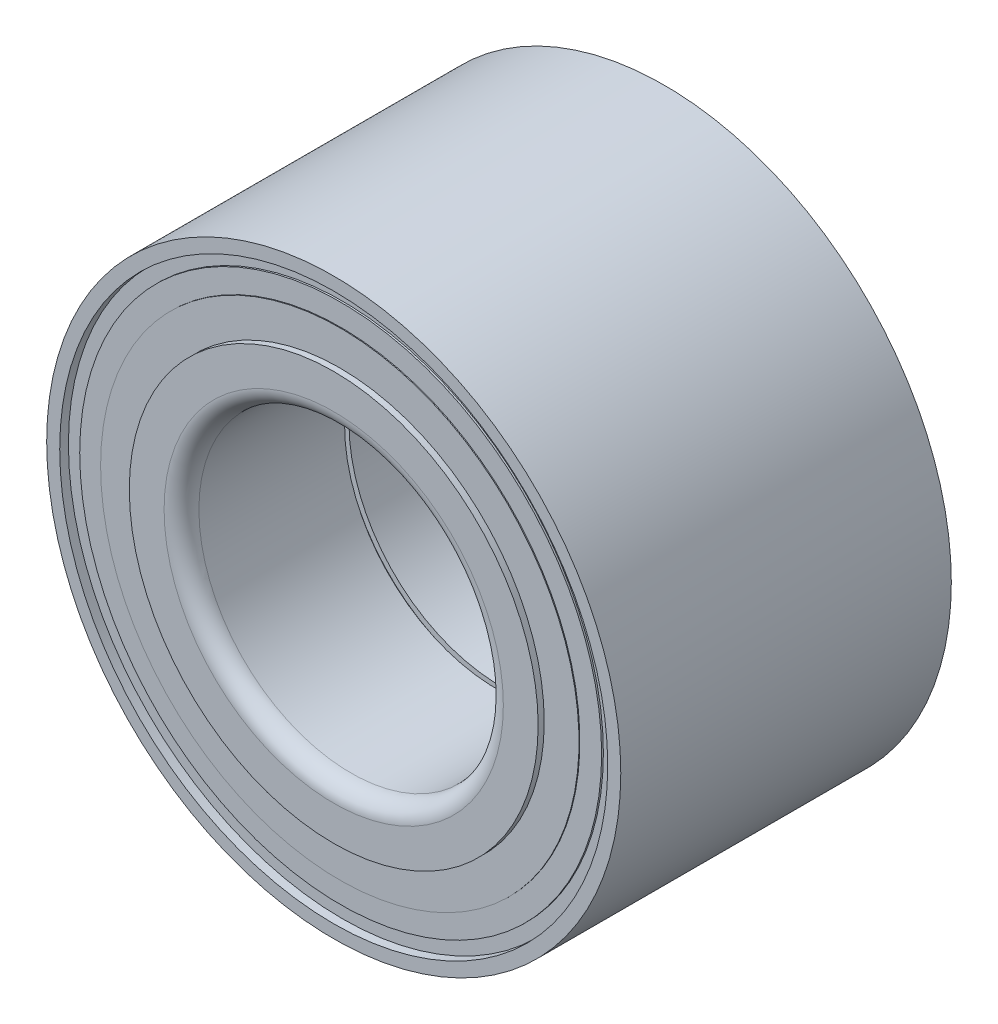
ISO-10303-21;
HEADER;
FILE_DESCRIPTION(('STEP AP214'),'2;1');
FILE_NAME('part.step','',(''),(''),'','','');
FILE_SCHEMA(('AUTOMOTIVE_DESIGN { 1 0 10303 214 1 1 1 1 }'));
ENDSEC;
DATA;
#1=APPLICATION_CONTEXT('core data for automotive mechanical design processes');
#2=APPLICATION_PROTOCOL_DEFINITION('international standard','automotive_design',2000,#1);
#3=PRODUCT_CONTEXT('',#1,'mechanical');
#4=PRODUCT('Part','Part','',(#3));
#5=PRODUCT_RELATED_PRODUCT_CATEGORY('part','',(#4));
#6=PRODUCT_DEFINITION_FORMATION('','',#4);
#7=PRODUCT_DEFINITION_CONTEXT('part definition',#1,'design');
#8=PRODUCT_DEFINITION('design','',#6,#7);
#9=PRODUCT_DEFINITION_SHAPE('','',#8);
#10=(LENGTH_UNIT() NAMED_UNIT(*) SI_UNIT(.MILLI.,.METRE.));
#11=(NAMED_UNIT(*) PLANE_ANGLE_UNIT() SI_UNIT($,.RADIAN.));
#12=(NAMED_UNIT(*) SI_UNIT($,.STERADIAN.) SOLID_ANGLE_UNIT());
#13=UNCERTAINTY_MEASURE_WITH_UNIT(LENGTH_MEASURE(1.E-05),#10,'distance_accuracy_value','');
#14=(GEOMETRIC_REPRESENTATION_CONTEXT(3) GLOBAL_UNCERTAINTY_ASSIGNED_CONTEXT((#13)) GLOBAL_UNIT_ASSIGNED_CONTEXT((#10,
#11,#12)) REPRESENTATION_CONTEXT('',''));
#15=CARTESIAN_POINT('',(0.,0.,0.));
#16=DIRECTION('',(0.,0.,1.));
#17=DIRECTION('',(1.,0.,0.));
#18=AXIS2_PLACEMENT_3D('',#15,#16,#17);
#19=CARTESIAN_POINT('',(0.,0.,-19.));
#20=DIRECTION('',(0.,0.,1.));
#21=DIRECTION('',(1.,0.,0.));
#22=AXIS2_PLACEMENT_3D('',#19,#20,#21);
#23=PLANE('',#22);
#24=CARTESIAN_POINT('',(0.,0.,-19.));
#25=DIRECTION('',(0.,0.,-1.));
#26=DIRECTION('',(-1.,0.,0.));
#27=AXIS2_PLACEMENT_3D('',#24,#25,#26);
#28=CIRCLE('',#27,23.5);
#29=CARTESIAN_POINT('',(-23.5,0.,-19.));
#30=VERTEX_POINT('',#29);
#31=EDGE_CURVE('E124',#30,#30,#28,.T.);
#32=ORIENTED_EDGE('',*,*,#31,.T.);
#33=EDGE_LOOP('',(#32));
#34=FACE_BOUND('',#33,.T.);
#35=CARTESIAN_POINT('',(0.,0.,-19.));
#36=DIRECTION('',(0.,0.,1.));
#37=DIRECTION('',(1.,0.,0.));
#38=AXIS2_PLACEMENT_3D('',#35,#36,#37);
#39=CIRCLE('',#38,19.5);
#40=CARTESIAN_POINT('',(19.5,0.,-19.));
#41=VERTEX_POINT('',#40);
#42=EDGE_CURVE('E42',#41,#41,#39,.T.);
#43=ORIENTED_EDGE('',*,*,#42,.T.);
#44=EDGE_LOOP('',(#43));
#45=FACE_BOUND('',#44,.T.);
#46=ADVANCED_FACE('F35',(#34,#45),#23,.F.);
#47=CARTESIAN_POINT('',(0.,0.,19.));
#48=DIRECTION('',(0.,0.,1.));
#49=DIRECTION('',(1.,0.,0.));
#50=AXIS2_PLACEMENT_3D('',#47,#48,#49);
#51=PLANE('',#50);
#52=CARTESIAN_POINT('',(0.,0.,19.));
#53=DIRECTION('',(0.,0.,-1.));
#54=DIRECTION('',(-1.,0.,0.));
#55=AXIS2_PLACEMENT_3D('',#52,#53,#54);
#56=CIRCLE('',#55,23.5);
#57=CARTESIAN_POINT('',(-23.5,0.,19.));
#58=VERTEX_POINT('',#57);
#59=EDGE_CURVE('E100',#58,#58,#56,.T.);
#60=ORIENTED_EDGE('',*,*,#59,.F.);
#61=EDGE_LOOP('',(#60));
#62=FACE_BOUND('',#61,.T.);
#63=CARTESIAN_POINT('',(0.,0.,19.));
#64=DIRECTION('',(0.,0.,1.));
#65=DIRECTION('',(1.,0.,0.));
#66=AXIS2_PLACEMENT_3D('',#63,#64,#65);
#67=CIRCLE('',#66,19.5);
#68=CARTESIAN_POINT('',(19.5,0.,19.));
#69=VERTEX_POINT('',#68);
#70=EDGE_CURVE('E46',#69,#69,#67,.F.);
#71=ORIENTED_EDGE('',*,*,#70,.T.);
#72=EDGE_LOOP('',(#71));
#73=FACE_BOUND('',#72,.T.);
#74=ADVANCED_FACE('F145',(#62,#73),#51,.T.);
#75=CARTESIAN_POINT('',(0.,0.,19.));
#76=DIRECTION('',(0.,0.,-1.));
#77=DIRECTION('',(-1.,0.,0.));
#78=AXIS2_PLACEMENT_3D('',#75,#76,#77);
#79=CYLINDRICAL_SURFACE('',#78,17.5);
#80=CARTESIAN_POINT('',(0.,0.,-17.));
#81=DIRECTION('',(0.,0.,1.));
#82=DIRECTION('',(1.,0.,0.));
#83=AXIS2_PLACEMENT_3D('',#80,#81,#82);
#84=CIRCLE('',#83,17.5);
#85=CARTESIAN_POINT('',(17.5,0.,-17.));
#86=VERTEX_POINT('',#85);
#87=EDGE_CURVE('E10',#86,#86,#84,.F.);
#88=ORIENTED_EDGE('',*,*,#87,.T.);
#89=EDGE_LOOP('',(#88));
#90=FACE_BOUND('',#89,.T.);
#91=CARTESIAN_POINT('',(0.,0.,-0.250000000000002));
#92=DIRECTION('',(0.,0.,1.));
#93=DIRECTION('',(1.,0.,0.));
#94=AXIS2_PLACEMENT_3D('',#91,#92,#93);
#95=CIRCLE('',#94,17.5);
#96=CARTESIAN_POINT('',(17.5,0.,-0.250000000000002));
#97=VERTEX_POINT('',#96);
#98=EDGE_CURVE('E70',#97,#97,#95,.T.);
#99=ORIENTED_EDGE('',*,*,#98,.T.);
#100=EDGE_LOOP('',(#99));
#101=FACE_BOUND('',#100,.T.);
#102=ADVANCED_FACE('F151',(#90,#101),#79,.F.);
#103=CARTESIAN_POINT('',(0.,0.,19.));
#104=DIRECTION('',(0.,0.,-1.));
#105=DIRECTION('',(-1.,0.,0.));
#106=AXIS2_PLACEMENT_3D('',#103,#104,#105);
#107=CIRCLE('',#106,31.5);
#108=CARTESIAN_POINT('',(-31.5,0.,19.));
#109=VERTEX_POINT('',#108);
#110=EDGE_CURVE('E97',#109,#109,#107,.T.);
#111=ORIENTED_EDGE('',*,*,#110,.T.);
#112=EDGE_LOOP('',(#111));
#113=FACE_BOUND('',#112,.T.);
#114=CARTESIAN_POINT('',(0.,0.,19.));
#115=DIRECTION('',(0.,0.,1.));
#116=DIRECTION('',(1.,0.,0.));
#117=AXIS2_PLACEMENT_3D('',#114,#115,#116);
#118=CIRCLE('',#117,33.);
#119=CARTESIAN_POINT('',(33.,0.,19.));
#120=VERTEX_POINT('',#119);
#121=EDGE_CURVE('E55',#120,#120,#118,.T.);
#122=ORIENTED_EDGE('',*,*,#121,.T.);
#123=EDGE_LOOP('',(#122));
#124=FACE_BOUND('',#123,.T.);
#125=ADVANCED_FACE('F154',(#113,#124),#51,.T.);
#126=CARTESIAN_POINT('',(0.,0.,-19.));
#127=DIRECTION('',(0.,0.,-1.));
#128=DIRECTION('',(-1.,0.,0.));
#129=AXIS2_PLACEMENT_3D('',#126,#127,#128);
#130=CIRCLE('',#129,31.5);
#131=CARTESIAN_POINT('',(-31.5,0.,-19.));
#132=VERTEX_POINT('',#131);
#133=EDGE_CURVE('E121',#132,#132,#130,.T.);
#134=ORIENTED_EDGE('',*,*,#133,.F.);
#135=EDGE_LOOP('',(#134));
#136=FACE_BOUND('',#135,.T.);
#137=CARTESIAN_POINT('',(0.,0.,-19.));
#138=DIRECTION('',(0.,0.,1.));
#139=DIRECTION('',(1.,0.,0.));
#140=AXIS2_PLACEMENT_3D('',#137,#138,#139);
#141=CIRCLE('',#140,33.);
#142=CARTESIAN_POINT('',(33.,0.,-19.));
#143=VERTEX_POINT('',#142);
#144=EDGE_CURVE('E56',#143,#143,#141,.T.);
#145=ORIENTED_EDGE('',*,*,#144,.F.);
#146=EDGE_LOOP('',(#145));
#147=FACE_BOUND('',#146,.T.);
#148=ADVANCED_FACE('F147',(#136,#147),#23,.F.);
#149=CARTESIAN_POINT('',(0.,0.,19.));
#150=DIRECTION('',(0.,0.,-1.));
#151=DIRECTION('',(-1.,0.,0.));
#152=AXIS2_PLACEMENT_3D('',#149,#150,#151);
#153=CYLINDRICAL_SURFACE('',#152,33.);
#154=ORIENTED_EDGE('',*,*,#121,.F.);
#155=EDGE_LOOP('',(#154));
#156=FACE_BOUND('',#155,.T.);
#157=ORIENTED_EDGE('',*,*,#144,.T.);
#158=EDGE_LOOP('',(#157));
#159=FACE_BOUND('',#158,.T.);
#160=ADVANCED_FACE('F157',(#156,#159),#153,.T.);
#161=CARTESIAN_POINT('',(0.,0.,17.));
#162=DIRECTION('',(0.,0.,1.));
#163=DIRECTION('',(1.,0.,0.));
#164=AXIS2_PLACEMENT_3D('',#161,#162,#163);
#165=CIRCLE('',#164,17.5);
#166=CARTESIAN_POINT('',(17.5,0.,17.));
#167=VERTEX_POINT('',#166);
#168=EDGE_CURVE('E50',#167,#167,#165,.T.);
#169=ORIENTED_EDGE('',*,*,#168,.T.);
#170=EDGE_LOOP('',(#169));
#171=FACE_BOUND('',#170,.T.);
#172=CARTESIAN_POINT('',(0.,0.,0.250000000000002));
#173=DIRECTION('',(0.,0.,1.));
#174=DIRECTION('',(1.,0.,0.));
#175=AXIS2_PLACEMENT_3D('',#172,#173,#174);
#176=CIRCLE('',#175,17.5);
#177=CARTESIAN_POINT('',(17.5,0.,0.250000000000002));
#178=VERTEX_POINT('',#177);
#179=EDGE_CURVE('E67',#178,#178,#176,.T.);
#180=ORIENTED_EDGE('',*,*,#179,.F.);
#181=EDGE_LOOP('',(#180));
#182=FACE_BOUND('',#181,.T.);
#183=ADVANCED_FACE('F163',(#171,#182),#79,.F.);
#184=CARTESIAN_POINT('',(0.,0.,0.));
#185=DIRECTION('',(0.,0.,1.));
#186=DIRECTION('',(1.,0.,0.));
#187=AXIS2_PLACEMENT_3D('',#184,#185,#186);
#188=CYLINDRICAL_SURFACE('',#187,18.5);
#189=CARTESIAN_POINT('',(0.,0.,-0.500000000000002));
#190=DIRECTION('',(0.,0.,1.));
#191=DIRECTION('',(1.,0.,0.));
#192=AXIS2_PLACEMENT_3D('',#189,#190,#191);
#193=CIRCLE('',#192,18.5);
#194=CARTESIAN_POINT('',(18.5,0.,-0.500000000000002));
#195=VERTEX_POINT('',#194);
#196=EDGE_CURVE('E76',#195,#195,#193,.T.);
#197=ORIENTED_EDGE('',*,*,#196,.F.);
#198=EDGE_LOOP('',(#197));
#199=FACE_BOUND('',#198,.T.);
#200=CARTESIAN_POINT('',(0.,0.,0.499999999999998));
#201=DIRECTION('',(0.,0.,1.));
#202=DIRECTION('',(1.,0.,0.));
#203=AXIS2_PLACEMENT_3D('',#200,#201,#202);
#204=CIRCLE('',#203,18.5);
#205=CARTESIAN_POINT('',(18.5,0.,0.499999999999998));
#206=VERTEX_POINT('',#205);
#207=EDGE_CURVE('E59',#206,#206,#204,.T.);
#208=ORIENTED_EDGE('',*,*,#207,.T.);
#209=EDGE_LOOP('',(#208));
#210=FACE_BOUND('',#209,.T.);
#211=ADVANCED_FACE('F367',(#199,#210),#188,.F.);
#212=CARTESIAN_POINT('',(18.5,0.,0.5));
#213=DIRECTION('',(0.,0.,1.));
#214=DIRECTION('',(1.,0.,0.));
#215=AXIS2_PLACEMENT_3D('',#212,#213,#214);
#216=PLANE('',#215);
#217=ORIENTED_EDGE('',*,*,#207,.F.);
#218=EDGE_LOOP('',(#217));
#219=FACE_BOUND('',#218,.T.);
#220=CARTESIAN_POINT('',(0.,0.,0.500000000000002));
#221=DIRECTION('',(0.,0.,1.));
#222=DIRECTION('',(1.,0.,0.));
#223=AXIS2_PLACEMENT_3D('',#220,#221,#222);
#224=CIRCLE('',#223,17.75);
#225=CARTESIAN_POINT('',(17.75,0.,0.500000000000002));
#226=VERTEX_POINT('',#225);
#227=EDGE_CURVE('E64',#226,#226,#224,.T.);
#228=ORIENTED_EDGE('',*,*,#227,.T.);
#229=EDGE_LOOP('',(#228));
#230=FACE_BOUND('',#229,.T.);
#231=ADVANCED_FACE('F358',(#219,#230),#216,.F.);
#232=CARTESIAN_POINT('',(0.,0.,0.250000000000002));
#233=DIRECTION('',(0.,0.,1.));
#234=DIRECTION('',(1.,0.,0.));
#235=AXIS2_PLACEMENT_3D('',#232,#233,#234);
#236=TOROIDAL_SURFACE('',#235,17.75,0.25);
#237=ORIENTED_EDGE('',*,*,#227,.F.);
#238=EDGE_LOOP('',(#237));
#239=FACE_BOUND('',#238,.T.);
#240=ORIENTED_EDGE('',*,*,#179,.T.);
#241=EDGE_LOOP('',(#240));
#242=FACE_BOUND('',#241,.T.);
#243=ADVANCED_FACE('F349',(#239,#242),#236,.F.);
#244=CARTESIAN_POINT('',(0.,0.,-0.250000000000002));
#245=DIRECTION('',(0.,0.,1.));
#246=DIRECTION('',(1.,0.,0.));
#247=AXIS2_PLACEMENT_3D('',#244,#245,#246);
#248=TOROIDAL_SURFACE('',#247,17.75,0.25);
#249=ORIENTED_EDGE('',*,*,#98,.F.);
#250=EDGE_LOOP('',(#249));
#251=FACE_BOUND('',#250,.T.);
#252=CARTESIAN_POINT('',(0.,0.,-0.500000000000002));
#253=DIRECTION('',(0.,0.,1.));
#254=DIRECTION('',(1.,0.,0.));
#255=AXIS2_PLACEMENT_3D('',#252,#253,#254);
#256=CIRCLE('',#255,17.75);
#257=CARTESIAN_POINT('',(17.75,0.,-0.500000000000002));
#258=VERTEX_POINT('',#257);
#259=EDGE_CURVE('E73',#258,#258,#256,.T.);
#260=ORIENTED_EDGE('',*,*,#259,.T.);
#261=EDGE_LOOP('',(#260));
#262=FACE_BOUND('',#261,.T.);
#263=ADVANCED_FACE('F339',(#251,#262),#248,.F.);
#264=CARTESIAN_POINT('',(17.75,0.,-0.500000000000002));
#265=DIRECTION('',(0.,0.,-1.));
#266=DIRECTION('',(-1.,0.,0.));
#267=AXIS2_PLACEMENT_3D('',#264,#265,#266);
#268=PLANE('',#267);
#269=ORIENTED_EDGE('',*,*,#259,.F.);
#270=EDGE_LOOP('',(#269));
#271=FACE_BOUND('',#270,.T.);
#272=ORIENTED_EDGE('',*,*,#196,.T.);
#273=EDGE_LOOP('',(#272));
#274=FACE_BOUND('',#273,.T.);
#275=ADVANCED_FACE('F329',(#271,#274),#268,.F.);
#276=CARTESIAN_POINT('',(0.,0.,17.));
#277=DIRECTION('',(0.,0.,1.));
#278=DIRECTION('',(1.,0.,0.));
#279=AXIS2_PLACEMENT_3D('',#276,#277,#278);
#280=TOROIDAL_SURFACE('',#279,19.5,2.);
#281=ORIENTED_EDGE('',*,*,#70,.F.);
#282=EDGE_LOOP('',(#281));
#283=FACE_BOUND('',#282,.T.);
#284=ORIENTED_EDGE('',*,*,#168,.F.);
#285=EDGE_LOOP('',(#284));
#286=FACE_BOUND('',#285,.T.);
#287=ADVANCED_FACE('F313',(#283,#286),#280,.T.);
#288=CARTESIAN_POINT('',(0.,0.,0.));
#289=DIRECTION('',(0.,0.,-1.));
#290=DIRECTION('',(-1.,0.,0.));
#291=AXIS2_PLACEMENT_3D('',#288,#289,#290);
#292=CYLINDRICAL_SURFACE('',#291,23.5);
#293=CARTESIAN_POINT('',(0.,0.,18.3));
#294=DIRECTION('',(0.,0.,-1.));
#295=DIRECTION('',(-1.,0.,0.));
#296=AXIS2_PLACEMENT_3D('',#293,#294,#295);
#297=CIRCLE('',#296,23.5);
#298=CARTESIAN_POINT('',(-23.5,0.,18.3));
#299=VERTEX_POINT('',#298);
#300=EDGE_CURVE('E79',#299,#299,#297,.T.);
#301=ORIENTED_EDGE('',*,*,#300,.F.);
#302=EDGE_LOOP('',(#301));
#303=FACE_BOUND('',#302,.T.);
#304=ORIENTED_EDGE('',*,*,#59,.T.);
#305=EDGE_LOOP('',(#304));
#306=FACE_BOUND('',#305,.T.);
#307=ADVANCED_FACE('F304',(#303,#306),#292,.T.);
#308=CARTESIAN_POINT('',(0.,23.5,18.3));
#309=DIRECTION('',(0.,0.,-1.));
#310=DIRECTION('',(-1.,0.,0.));
#311=AXIS2_PLACEMENT_3D('',#308,#309,#310);
#312=PLANE('',#311);
#313=CARTESIAN_POINT('',(0.,0.,18.3));
#314=DIRECTION('',(0.,0.,-1.));
#315=DIRECTION('',(-1.,0.,0.));
#316=AXIS2_PLACEMENT_3D('',#313,#314,#315);
#317=CIRCLE('',#316,27.5);
#318=CARTESIAN_POINT('',(-27.5,0.,18.3));
#319=VERTEX_POINT('',#318);
#320=EDGE_CURVE('E82',#319,#319,#317,.T.);
#321=ORIENTED_EDGE('',*,*,#320,.F.);
#322=EDGE_LOOP('',(#321));
#323=FACE_BOUND('',#322,.T.);
#324=ORIENTED_EDGE('',*,*,#300,.T.);
#325=EDGE_LOOP('',(#324));
#326=FACE_BOUND('',#325,.T.);
#327=ADVANCED_FACE('F295',(#323,#326),#312,.F.);
#328=CARTESIAN_POINT('',(0.,0.,0.));
#329=DIRECTION('',(0.,0.,-1.));
#330=DIRECTION('',(-1.,0.,0.));
#331=AXIS2_PLACEMENT_3D('',#328,#329,#330);
#332=CYLINDRICAL_SURFACE('',#331,27.5);
#333=CARTESIAN_POINT('',(0.,0.,18.2));
#334=DIRECTION('',(0.,0.,-1.));
#335=DIRECTION('',(-1.,0.,0.));
#336=AXIS2_PLACEMENT_3D('',#333,#334,#335);
#337=CIRCLE('',#336,27.5);
#338=CARTESIAN_POINT('',(-27.5,0.,18.2));
#339=VERTEX_POINT('',#338);
#340=EDGE_CURVE('E85',#339,#339,#337,.T.);
#341=ORIENTED_EDGE('',*,*,#340,.F.);
#342=EDGE_LOOP('',(#341));
#343=FACE_BOUND('',#342,.T.);
#344=ORIENTED_EDGE('',*,*,#320,.T.);
#345=EDGE_LOOP('',(#344));
#346=FACE_BOUND('',#345,.T.);
#347=ADVANCED_FACE('F286',(#343,#346),#332,.T.);
#348=CARTESIAN_POINT('',(0.,27.5,18.2));
#349=DIRECTION('',(0.,0.,-1.));
#350=DIRECTION('',(-1.,0.,0.));
#351=AXIS2_PLACEMENT_3D('',#348,#349,#350);
#352=PLANE('',#351);
#353=CARTESIAN_POINT('',(0.,0.,18.2));
#354=DIRECTION('',(0.,0.,-1.));
#355=DIRECTION('',(-1.,0.,0.));
#356=AXIS2_PLACEMENT_3D('',#353,#354,#355);
#357=CIRCLE('',#356,30.);
#358=CARTESIAN_POINT('',(-30.,0.,18.2));
#359=VERTEX_POINT('',#358);
#360=EDGE_CURVE('E88',#359,#359,#357,.T.);
#361=ORIENTED_EDGE('',*,*,#360,.F.);
#362=EDGE_LOOP('',(#361));
#363=FACE_BOUND('',#362,.T.);
#364=ORIENTED_EDGE('',*,*,#340,.T.);
#365=EDGE_LOOP('',(#364));
#366=FACE_BOUND('',#365,.T.);
#367=ADVANCED_FACE('F277',(#363,#366),#352,.F.);
#368=CARTESIAN_POINT('',(0.,0.,0.));
#369=DIRECTION('',(0.,0.,-1.));
#370=DIRECTION('',(-1.,0.,0.));
#371=AXIS2_PLACEMENT_3D('',#368,#369,#370);
#372=CYLINDRICAL_SURFACE('',#371,30.);
#373=CARTESIAN_POINT('',(0.,0.,18.));
#374=DIRECTION('',(0.,0.,-1.));
#375=DIRECTION('',(-1.,0.,0.));
#376=AXIS2_PLACEMENT_3D('',#373,#374,#375);
#377=CIRCLE('',#376,30.);
#378=CARTESIAN_POINT('',(-30.,0.,18.));
#379=VERTEX_POINT('',#378);
#380=EDGE_CURVE('E91',#379,#379,#377,.T.);
#381=ORIENTED_EDGE('',*,*,#380,.F.);
#382=EDGE_LOOP('',(#381));
#383=FACE_BOUND('',#382,.T.);
#384=ORIENTED_EDGE('',*,*,#360,.T.);
#385=EDGE_LOOP('',(#384));
#386=FACE_BOUND('',#385,.T.);
#387=ADVANCED_FACE('F268',(#383,#386),#372,.T.);
#388=CARTESIAN_POINT('',(0.,30.,18.));
#389=DIRECTION('',(0.,0.,-1.));
#390=DIRECTION('',(-1.,0.,0.));
#391=AXIS2_PLACEMENT_3D('',#388,#389,#390);
#392=PLANE('',#391);
#393=CARTESIAN_POINT('',(0.,0.,18.));
#394=DIRECTION('',(0.,0.,-1.));
#395=DIRECTION('',(-1.,0.,0.));
#396=AXIS2_PLACEMENT_3D('',#393,#394,#395);
#397=CIRCLE('',#396,31.5);
#398=CARTESIAN_POINT('',(-31.5,0.,18.));
#399=VERTEX_POINT('',#398);
#400=EDGE_CURVE('E94',#399,#399,#397,.T.);
#401=ORIENTED_EDGE('',*,*,#400,.F.);
#402=EDGE_LOOP('',(#401));
#403=FACE_BOUND('',#402,.T.);
#404=ORIENTED_EDGE('',*,*,#380,.T.);
#405=EDGE_LOOP('',(#404));
#406=FACE_BOUND('',#405,.T.);
#407=ADVANCED_FACE('F260',(#403,#406),#392,.F.);
#408=CARTESIAN_POINT('',(0.,0.,0.));
#409=DIRECTION('',(0.,0.,-1.));
#410=DIRECTION('',(-1.,0.,0.));
#411=AXIS2_PLACEMENT_3D('',#408,#409,#410);
#412=CYLINDRICAL_SURFACE('',#411,31.5);
#413=ORIENTED_EDGE('',*,*,#110,.F.);
#414=EDGE_LOOP('',(#413));
#415=FACE_BOUND('',#414,.T.);
#416=ORIENTED_EDGE('',*,*,#400,.T.);
#417=EDGE_LOOP('',(#416));
#418=FACE_BOUND('',#417,.T.);
#419=ADVANCED_FACE('F141',(#415,#418),#412,.F.);
#420=CARTESIAN_POINT('',(0.,0.,-17.));
#421=DIRECTION('',(0.,0.,1.));
#422=DIRECTION('',(1.,0.,0.));
#423=AXIS2_PLACEMENT_3D('',#420,#421,#422);
#424=TOROIDAL_SURFACE('',#423,19.5,2.);
#425=ORIENTED_EDGE('',*,*,#87,.F.);
#426=EDGE_LOOP('',(#425));
#427=FACE_BOUND('',#426,.T.);
#428=ORIENTED_EDGE('',*,*,#42,.F.);
#429=EDGE_LOOP('',(#428));
#430=FACE_BOUND('',#429,.T.);
#431=ADVANCED_FACE('F37',(#427,#430),#424,.T.);
#432=CARTESIAN_POINT('',(0.,0.,0.));
#433=DIRECTION('',(0.,0.,1.));
#434=DIRECTION('',(-1.,0.,0.));
#435=AXIS2_PLACEMENT_3D('',#432,#433,#434);
#436=CYLINDRICAL_SURFACE('',#435,23.5);
#437=CARTESIAN_POINT('',(0.,0.,-18.3));
#438=DIRECTION('',(0.,0.,-1.));
#439=DIRECTION('',(-1.,0.,0.));
#440=AXIS2_PLACEMENT_3D('',#437,#438,#439);
#441=CIRCLE('',#440,23.5);
#442=CARTESIAN_POINT('',(-23.5,0.,-18.3));
#443=VERTEX_POINT('',#442);
#444=EDGE_CURVE('E103',#443,#443,#441,.T.);
#445=ORIENTED_EDGE('',*,*,#444,.T.);
#446=EDGE_LOOP('',(#445));
#447=FACE_BOUND('',#446,.T.);
#448=ORIENTED_EDGE('',*,*,#31,.F.);
#449=EDGE_LOOP('',(#448));
#450=FACE_BOUND('',#449,.T.);
#451=ADVANCED_FACE('F129',(#447,#450),#436,.T.);
#452=CARTESIAN_POINT('',(0.,23.5,-18.3));
#453=DIRECTION('',(0.,0.,1.));
#454=DIRECTION('',(-1.,0.,0.));
#455=AXIS2_PLACEMENT_3D('',#452,#453,#454);
#456=PLANE('',#455);
#457=CARTESIAN_POINT('',(0.,0.,-18.3));
#458=DIRECTION('',(0.,0.,-1.));
#459=DIRECTION('',(-1.,0.,0.));
#460=AXIS2_PLACEMENT_3D('',#457,#458,#459);
#461=CIRCLE('',#460,27.5);
#462=CARTESIAN_POINT('',(-27.5,0.,-18.3));
#463=VERTEX_POINT('',#462);
#464=EDGE_CURVE('E106',#463,#463,#461,.T.);
#465=ORIENTED_EDGE('',*,*,#464,.T.);
#466=EDGE_LOOP('',(#465));
#467=FACE_BOUND('',#466,.T.);
#468=ORIENTED_EDGE('',*,*,#444,.F.);
#469=EDGE_LOOP('',(#468));
#470=FACE_BOUND('',#469,.T.);
#471=ADVANCED_FACE('F131',(#467,#470),#456,.F.);
#472=CARTESIAN_POINT('',(0.,0.,0.));
#473=DIRECTION('',(0.,0.,1.));
#474=DIRECTION('',(-1.,0.,0.));
#475=AXIS2_PLACEMENT_3D('',#472,#473,#474);
#476=CYLINDRICAL_SURFACE('',#475,27.5);
#477=CARTESIAN_POINT('',(0.,0.,-18.2));
#478=DIRECTION('',(0.,0.,-1.));
#479=DIRECTION('',(-1.,0.,0.));
#480=AXIS2_PLACEMENT_3D('',#477,#478,#479);
#481=CIRCLE('',#480,27.5);
#482=CARTESIAN_POINT('',(-27.5,0.,-18.2));
#483=VERTEX_POINT('',#482);
#484=EDGE_CURVE('E109',#483,#483,#481,.T.);
#485=ORIENTED_EDGE('',*,*,#484,.T.);
#486=EDGE_LOOP('',(#485));
#487=FACE_BOUND('',#486,.T.);
#488=ORIENTED_EDGE('',*,*,#464,.F.);
#489=EDGE_LOOP('',(#488));
#490=FACE_BOUND('',#489,.T.);
#491=ADVANCED_FACE('F138',(#487,#490),#476,.T.);
#492=CARTESIAN_POINT('',(0.,27.5,-18.2));
#493=DIRECTION('',(0.,0.,1.));
#494=DIRECTION('',(-1.,0.,0.));
#495=AXIS2_PLACEMENT_3D('',#492,#493,#494);
#496=PLANE('',#495);
#497=CARTESIAN_POINT('',(0.,0.,-18.2));
#498=DIRECTION('',(0.,0.,-1.));
#499=DIRECTION('',(-1.,0.,0.));
#500=AXIS2_PLACEMENT_3D('',#497,#498,#499);
#501=CIRCLE('',#500,30.);
#502=CARTESIAN_POINT('',(-30.,0.,-18.2));
#503=VERTEX_POINT('',#502);
#504=EDGE_CURVE('E112',#503,#503,#501,.T.);
#505=ORIENTED_EDGE('',*,*,#504,.T.);
#506=EDGE_LOOP('',(#505));
#507=FACE_BOUND('',#506,.T.);
#508=ORIENTED_EDGE('',*,*,#484,.F.);
#509=EDGE_LOOP('',(#508));
#510=FACE_BOUND('',#509,.T.);
#511=ADVANCED_FACE('F186',(#507,#510),#496,.F.);
#512=CARTESIAN_POINT('',(0.,0.,0.));
#513=DIRECTION('',(0.,0.,1.));
#514=DIRECTION('',(-1.,0.,0.));
#515=AXIS2_PLACEMENT_3D('',#512,#513,#514);
#516=CYLINDRICAL_SURFACE('',#515,30.);
#517=CARTESIAN_POINT('',(0.,0.,-18.));
#518=DIRECTION('',(0.,0.,-1.));
#519=DIRECTION('',(-1.,0.,0.));
#520=AXIS2_PLACEMENT_3D('',#517,#518,#519);
#521=CIRCLE('',#520,30.);
#522=CARTESIAN_POINT('',(-30.,0.,-18.));
#523=VERTEX_POINT('',#522);
#524=EDGE_CURVE('E115',#523,#523,#521,.T.);
#525=ORIENTED_EDGE('',*,*,#524,.T.);
#526=EDGE_LOOP('',(#525));
#527=FACE_BOUND('',#526,.T.);
#528=ORIENTED_EDGE('',*,*,#504,.F.);
#529=EDGE_LOOP('',(#528));
#530=FACE_BOUND('',#529,.T.);
#531=ADVANCED_FACE('F180',(#527,#530),#516,.T.);
#532=CARTESIAN_POINT('',(0.,30.,-18.));
#533=DIRECTION('',(0.,0.,1.));
#534=DIRECTION('',(-1.,0.,0.));
#535=AXIS2_PLACEMENT_3D('',#532,#533,#534);
#536=PLANE('',#535);
#537=CARTESIAN_POINT('',(0.,0.,-18.));
#538=DIRECTION('',(0.,0.,-1.));
#539=DIRECTION('',(-1.,0.,0.));
#540=AXIS2_PLACEMENT_3D('',#537,#538,#539);
#541=CIRCLE('',#540,31.5);
#542=CARTESIAN_POINT('',(-31.5,0.,-18.));
#543=VERTEX_POINT('',#542);
#544=EDGE_CURVE('E118',#543,#543,#541,.T.);
#545=ORIENTED_EDGE('',*,*,#544,.T.);
#546=EDGE_LOOP('',(#545));
#547=FACE_BOUND('',#546,.T.);
#548=ORIENTED_EDGE('',*,*,#524,.F.);
#549=EDGE_LOOP('',(#548));
#550=FACE_BOUND('',#549,.T.);
#551=ADVANCED_FACE('F174',(#547,#550),#536,.F.);
#552=CARTESIAN_POINT('',(0.,0.,0.));
#553=DIRECTION('',(0.,0.,1.));
#554=DIRECTION('',(-1.,0.,0.));
#555=AXIS2_PLACEMENT_3D('',#552,#553,#554);
#556=CYLINDRICAL_SURFACE('',#555,31.5);
#557=ORIENTED_EDGE('',*,*,#133,.T.);
#558=EDGE_LOOP('',(#557));
#559=FACE_BOUND('',#558,.T.);
#560=ORIENTED_EDGE('',*,*,#544,.F.);
#561=EDGE_LOOP('',(#560));
#562=FACE_BOUND('',#561,.T.);
#563=ADVANCED_FACE('F171',(#559,#562),#556,.F.);
#564=CLOSED_SHELL('',(#46,#74,#102,#125,#148,#160,#183,#211,#231,#243,#263,#275,#287,#307,#327,
#347,#367,#387,#407,#419,#431,#451,#471,#491,#511,#531,#551,#563));
#565=MANIFOLD_SOLID_BREP('B2',#564);
#566=ADVANCED_BREP_SHAPE_REPRESENTATION('',(#18,#565),#14);
#567=SHAPE_DEFINITION_REPRESENTATION(#9,#566);
ENDSEC;
END-ISO-10303-21;
